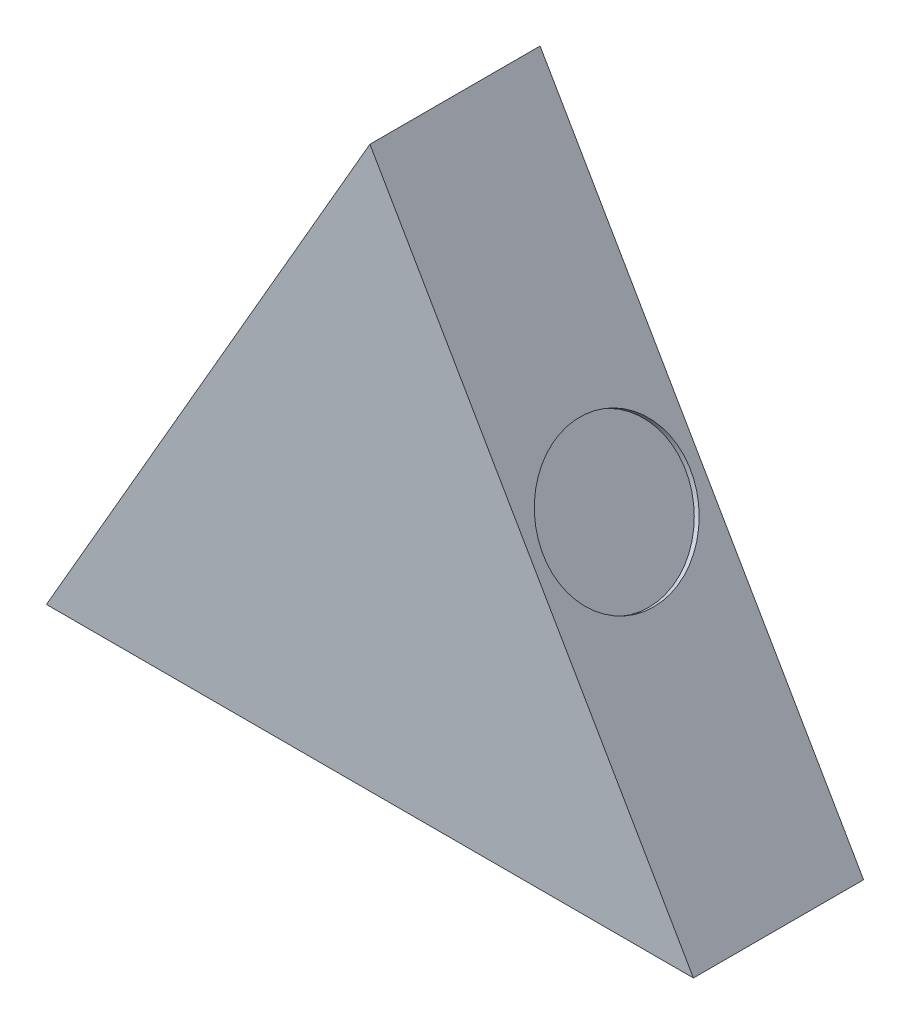
ISO-10303-21;
HEADER;
FILE_DESCRIPTION(('STEP AP214'),'2;1');
FILE_NAME('part.step','',(''),(''),'','','');
FILE_SCHEMA(('AUTOMOTIVE_DESIGN { 1 0 10303 214 1 1 1 1 }'));
ENDSEC;
DATA;
#1=APPLICATION_CONTEXT('core data for automotive mechanical design processes');
#2=APPLICATION_PROTOCOL_DEFINITION('international standard','automotive_design',2000,#1);
#3=PRODUCT_CONTEXT('',#1,'mechanical');
#4=PRODUCT('Part','Part','',(#3));
#5=PRODUCT_RELATED_PRODUCT_CATEGORY('part','',(#4));
#6=PRODUCT_DEFINITION_FORMATION('','',#4);
#7=PRODUCT_DEFINITION_CONTEXT('part definition',#1,'design');
#8=PRODUCT_DEFINITION('design','',#6,#7);
#9=PRODUCT_DEFINITION_SHAPE('','',#8);
#10=(LENGTH_UNIT() NAMED_UNIT(*) SI_UNIT(.MILLI.,.METRE.));
#11=(NAMED_UNIT(*) PLANE_ANGLE_UNIT() SI_UNIT($,.RADIAN.));
#12=(NAMED_UNIT(*) SI_UNIT($,.STERADIAN.) SOLID_ANGLE_UNIT());
#13=UNCERTAINTY_MEASURE_WITH_UNIT(LENGTH_MEASURE(1.E-05),#10,'distance_accuracy_value','');
#14=(GEOMETRIC_REPRESENTATION_CONTEXT(3) GLOBAL_UNCERTAINTY_ASSIGNED_CONTEXT((#13)) GLOBAL_UNIT_ASSIGNED_CONTEXT((#10,
#11,#12)) REPRESENTATION_CONTEXT('',''));
#15=CARTESIAN_POINT('',(0.,0.,0.));
#16=DIRECTION('',(0.,0.,1.));
#17=DIRECTION('',(1.,0.,0.));
#18=AXIS2_PLACEMENT_3D('',#15,#16,#17);
#19=CARTESIAN_POINT('',(0.,0.,0.));
#20=DIRECTION('',(0.,0.,1.));
#21=DIRECTION('',(1.,0.,0.));
#22=AXIS2_PLACEMENT_3D('',#19,#20,#21);
#23=PLANE('',#22);
#24=DIRECTION('',(-0.500000000000001,0.866025403784438,0.));
#25=VECTOR('',#24,1.);
#26=CARTESIAN_POINT('',(28.5177788775064,-24.6971209674279,0.));
#27=LINE('',#26,#25);
#28=CARTESIAN_POINT('',(28.5177788775064,-24.6971209674279,0.));
#29=VERTEX_POINT('',#28);
#30=CARTESIAN_POINT('',(-2.48065457064683E-13,24.6971209674279,0.));
#31=VERTEX_POINT('',#30);
#32=EDGE_CURVE('E163',#29,#31,#27,.T.);
#33=ORIENTED_EDGE('',*,*,#32,.F.);
#34=DIRECTION('',(1.,0.,0.));
#35=VECTOR('',#34,1.);
#36=CARTESIAN_POINT('',(-28.5177788775064,-24.6971209674279,0.));
#37=LINE('',#36,#35);
#38=CARTESIAN_POINT('',(-28.5177788775064,-24.6971209674279,0.));
#39=VERTEX_POINT('',#38);
#40=EDGE_CURVE('E79',#39,#29,#37,.T.);
#41=ORIENTED_EDGE('',*,*,#40,.F.);
#42=DIRECTION('',(-0.499999999999995,-0.866025403784442,0.));
#43=VECTOR('',#42,1.);
#44=CARTESIAN_POINT('',(-2.48065457064683E-13,24.6971209674279,0.));
#45=LINE('',#44,#43);
#46=EDGE_CURVE('E167',#31,#39,#45,.T.);
#47=ORIENTED_EDGE('',*,*,#46,.F.);
#48=EDGE_LOOP('',(#33,#41,#47));
#49=FACE_BOUND('',#48,.T.);
#50=CARTESIAN_POINT('',(0.,6.58100089794191,0.));
#51=DIRECTION('',(0.,0.,1.));
#52=DIRECTION('',(1.,0.,0.));
#53=AXIS2_PLACEMENT_3D('',#50,#51,#52);
#54=CIRCLE('',#53,3.92145220783505);
#55=CARTESIAN_POINT('',(2.37631234562467,9.70044428649156,0.));
#56=VERTEX_POINT('',#55);
#57=CARTESIAN_POINT('',(-2.37631234562468,9.70044428649156,0.));
#58=VERTEX_POINT('',#57);
#59=EDGE_CURVE('E53',#56,#58,#54,.T.);
#60=ORIENTED_EDGE('',*,*,#59,.T.);
#61=DIRECTION('',(-0.976410228367284,-0.215923750291041,0.));
#62=VECTOR('',#61,1.);
#63=CARTESIAN_POINT('',(-2.37631234562468,9.70044428649156,0.));
#64=LINE('',#63,#62);
#65=CARTESIAN_POINT('',(-3.41776144469771,9.47013781419549,0.));
#66=VERTEX_POINT('',#65);
#67=EDGE_CURVE('E162',#58,#66,#64,.T.);
#68=ORIENTED_EDGE('',*,*,#67,.T.);
#69=CARTESIAN_POINT('',(0.,-3.56299926426535,0.));
#70=DIRECTION('',(0.,0.,1.));
#71=DIRECTION('',(1.,0.,0.));
#72=AXIS2_PLACEMENT_3D('',#69,#70,#71);
#73=CIRCLE('',#72,13.4738174026077);
#74=CARTESIAN_POINT('',(-13.4738174026077,-3.56299926426536,0.));
#75=VERTEX_POINT('',#74);
#76=EDGE_CURVE('E245',#66,#75,#73,.T.);
#77=ORIENTED_EDGE('',*,*,#76,.T.);
#78=DIRECTION('',(0.,-1.,0.));
#79=VECTOR('',#78,1.);
#80=CARTESIAN_POINT('',(-13.4738174026077,-3.56299926426536,0.));
#81=LINE('',#80,#79);
#82=CARTESIAN_POINT('',(-13.4738174026077,-20.0629992642654,0.));
#83=VERTEX_POINT('',#82);
#84=EDGE_CURVE('E248',#75,#83,#81,.T.);
#85=ORIENTED_EDGE('',*,*,#84,.T.);
#86=CARTESIAN_POINT('',(-10.,-20.0629992642654,0.));
#87=DIRECTION('',(0.,0.,1.));
#88=DIRECTION('',(1.,0.,0.));
#89=AXIS2_PLACEMENT_3D('',#86,#87,#88);
#90=CIRCLE('',#89,3.47381740260768);
#91=CARTESIAN_POINT('',(-10.,-23.5368166668731,0.));
#92=VERTEX_POINT('',#91);
#93=EDGE_CURVE('E251',#83,#92,#90,.T.);
#94=ORIENTED_EDGE('',*,*,#93,.T.);
#95=DIRECTION('',(1.,0.,0.));
#96=VECTOR('',#95,1.);
#97=CARTESIAN_POINT('',(-10.,-23.5368166668731,0.));
#98=LINE('',#97,#96);
#99=CARTESIAN_POINT('',(10.,-23.536816666873,0.));
#100=VERTEX_POINT('',#99);
#101=EDGE_CURVE('E254',#92,#100,#98,.T.);
#102=ORIENTED_EDGE('',*,*,#101,.T.);
#103=CARTESIAN_POINT('',(10.,-20.0629992642654,0.));
#104=DIRECTION('',(0.,0.,1.));
#105=DIRECTION('',(1.,0.,0.));
#106=AXIS2_PLACEMENT_3D('',#103,#104,#105);
#107=CIRCLE('',#106,3.47381740260768);
#108=CARTESIAN_POINT('',(13.4738174026077,-20.0629992642654,0.));
#109=VERTEX_POINT('',#108);
#110=EDGE_CURVE('E257',#100,#109,#107,.T.);
#111=ORIENTED_EDGE('',*,*,#110,.T.);
#112=DIRECTION('',(0.,1.,0.));
#113=VECTOR('',#112,1.);
#114=CARTESIAN_POINT('',(13.4738174026077,-3.56299926426536,0.));
#115=LINE('',#114,#113);
#116=CARTESIAN_POINT('',(13.4738174026077,-3.56299926426535,0.));
#117=VERTEX_POINT('',#116);
#118=EDGE_CURVE('E260',#109,#117,#115,.T.);
#119=ORIENTED_EDGE('',*,*,#118,.T.);
#120=CARTESIAN_POINT('',(0.,-3.56299926426535,0.));
#121=DIRECTION('',(0.,0.,1.));
#122=DIRECTION('',(1.,0.,0.));
#123=AXIS2_PLACEMENT_3D('',#120,#121,#122);
#124=CIRCLE('',#123,13.4738174026077);
#125=CARTESIAN_POINT('',(3.41776144469768,9.4701378141955,0.));
#126=VERTEX_POINT('',#125);
#127=EDGE_CURVE('E263',#117,#126,#124,.T.);
#128=ORIENTED_EDGE('',*,*,#127,.T.);
#129=DIRECTION('',(-0.976410228367284,0.215923750291041,0.));
#130=VECTOR('',#129,1.);
#131=CARTESIAN_POINT('',(2.37631234562467,9.70044428649157,0.));
#132=LINE('',#131,#130);
#133=EDGE_CURVE('E158',#126,#56,#132,.T.);
#134=ORIENTED_EDGE('',*,*,#133,.T.);
#135=EDGE_LOOP('',(#60,#68,#77,#85,#94,#102,#111,#119,#128,#134));
#136=FACE_BOUND('',#135,.T.);
#137=ADVANCED_FACE('F38',(#49,#136),#23,.F.);
#138=CARTESIAN_POINT('',(28.5177788775064,-24.6971209674279,15.));
#139=DIRECTION('',(-0.866025403784438,-0.500000000000001,0.));
#140=DIRECTION('',(0.500000000000001,-0.866025403784438,0.));
#141=AXIS2_PLACEMENT_3D('',#138,#139,#140);
#142=PLANE('',#141);
#143=CARTESIAN_POINT('',(14.2588894387531,-1.5292080969564E-13,7.5));
#144=DIRECTION('',(-0.866025403784438,-0.500000000000001,0.));
#145=DIRECTION('',(0.500000000000001,-0.866025403784438,0.));
#146=AXIS2_PLACEMENT_3D('',#143,#144,#145);
#147=CIRCLE('',#146,6.5);
#148=CARTESIAN_POINT('',(17.5088894387532,-5.629165124599,7.5));
#149=VERTEX_POINT('',#148);
#150=EDGE_CURVE('E219',#149,#149,#147,.T.);
#151=ORIENTED_EDGE('',*,*,#150,.T.);
#152=EDGE_LOOP('',(#151));
#153=FACE_BOUND('',#152,.T.);
#154=ORIENTED_EDGE('',*,*,#32,.T.);
#155=DIRECTION('',(0.,0.,-1.));
#156=VECTOR('',#155,1.);
#157=CARTESIAN_POINT('',(-2.48065457064683E-13,24.6971209674279,15.));
#158=LINE('',#157,#156);
#159=CARTESIAN_POINT('',(-2.48065457064683E-13,24.6971209674279,15.));
#160=VERTEX_POINT('',#159);
#161=EDGE_CURVE('E11',#160,#31,#158,.T.);
#162=ORIENTED_EDGE('',*,*,#161,.F.);
#163=DIRECTION('',(-0.500000000000001,0.866025403784438,0.));
#164=VECTOR('',#163,1.);
#165=CARTESIAN_POINT('',(28.5177788775064,-24.6971209674279,15.));
#166=LINE('',#165,#164);
#167=CARTESIAN_POINT('',(28.5177788775064,-24.6971209674279,15.));
#168=VERTEX_POINT('',#167);
#169=EDGE_CURVE('E173',#168,#160,#166,.T.);
#170=ORIENTED_EDGE('',*,*,#169,.F.);
#171=DIRECTION('',(0.,0.,-1.));
#172=VECTOR('',#171,1.);
#173=CARTESIAN_POINT('',(28.5177788775064,-24.6971209674279,15.));
#174=LINE('',#173,#172);
#175=EDGE_CURVE('E176',#168,#29,#174,.T.);
#176=ORIENTED_EDGE('',*,*,#175,.T.);
#177=EDGE_LOOP('',(#154,#162,#170,#176));
#178=FACE_BOUND('',#177,.T.);
#179=ADVANCED_FACE('F40',(#153,#178),#142,.F.);
#180=CARTESIAN_POINT('',(-2.48065457064683E-13,24.6971209674279,15.));
#181=DIRECTION('',(0.866025403784442,-0.499999999999995,0.));
#182=DIRECTION('',(0.499999999999995,0.866025403784442,0.));
#183=AXIS2_PLACEMENT_3D('',#180,#181,#182);
#184=PLANE('',#183);
#185=CARTESIAN_POINT('',(-14.2588894387533,0.,7.5));
#186=DIRECTION('',(0.866025403784442,-0.499999999999995,0.));
#187=DIRECTION('',(0.499999999999995,0.866025403784442,0.));
#188=AXIS2_PLACEMENT_3D('',#185,#186,#187);
#189=CIRCLE('',#188,6.5);
#190=CARTESIAN_POINT('',(-11.0088894387534,5.62916512459883,7.5));
#191=VERTEX_POINT('',#190);
#192=EDGE_CURVE('E210',#191,#191,#189,.T.);
#193=ORIENTED_EDGE('',*,*,#192,.T.);
#194=EDGE_LOOP('',(#193));
#195=FACE_BOUND('',#194,.T.);
#196=ORIENTED_EDGE('',*,*,#46,.T.);
#197=DIRECTION('',(0.,0.,-1.));
#198=VECTOR('',#197,1.);
#199=CARTESIAN_POINT('',(-28.5177788775064,-24.6971209674279,15.));
#200=LINE('',#199,#198);
#201=CARTESIAN_POINT('',(-28.5177788775064,-24.6971209674279,15.));
#202=VERTEX_POINT('',#201);
#203=EDGE_CURVE('E46',#202,#39,#200,.T.);
#204=ORIENTED_EDGE('',*,*,#203,.F.);
#205=DIRECTION('',(-0.499999999999995,-0.866025403784442,0.));
#206=VECTOR('',#205,1.);
#207=CARTESIAN_POINT('',(-2.48065457064683E-13,24.6971209674279,15.));
#208=LINE('',#207,#206);
#209=EDGE_CURVE('E84',#160,#202,#208,.T.);
#210=ORIENTED_EDGE('',*,*,#209,.F.);
#211=ORIENTED_EDGE('',*,*,#161,.T.);
#212=EDGE_LOOP('',(#196,#204,#210,#211));
#213=FACE_BOUND('',#212,.T.);
#214=ADVANCED_FACE('F195',(#195,#213),#184,.F.);
#215=CARTESIAN_POINT('',(-28.5177788775064,-24.6971209674279,15.));
#216=DIRECTION('',(0.,1.,0.));
#217=DIRECTION('',(0.,0.,1.));
#218=AXIS2_PLACEMENT_3D('',#215,#216,#217);
#219=PLANE('',#218);
#220=CARTESIAN_POINT('',(0.,-24.6971209674279,7.5));
#221=DIRECTION('',(0.,-1.,0.));
#222=DIRECTION('',(0.,0.,-1.));
#223=AXIS2_PLACEMENT_3D('',#220,#221,#222);
#224=CIRCLE('',#223,6.5);
#225=CARTESIAN_POINT('',(0.,-24.6971209674279,0.999999999999999));
#226=VERTEX_POINT('',#225);
#227=EDGE_CURVE('E216',#226,#226,#224,.T.);
#228=ORIENTED_EDGE('',*,*,#227,.F.);
#229=EDGE_LOOP('',(#228));
#230=FACE_BOUND('',#229,.T.);
#231=ORIENTED_EDGE('',*,*,#40,.T.);
#232=ORIENTED_EDGE('',*,*,#175,.F.);
#233=DIRECTION('',(1.,0.,0.));
#234=VECTOR('',#233,1.);
#235=CARTESIAN_POINT('',(-28.5177788775064,-24.6971209674279,15.));
#236=LINE('',#235,#234);
#237=EDGE_CURVE('E62',#202,#168,#236,.T.);
#238=ORIENTED_EDGE('',*,*,#237,.F.);
#239=ORIENTED_EDGE('',*,*,#203,.T.);
#240=EDGE_LOOP('',(#231,#232,#238,#239));
#241=FACE_BOUND('',#240,.T.);
#242=ADVANCED_FACE('F180',(#230,#241),#219,.F.);
#243=CARTESIAN_POINT('',(0.,0.,15.));
#244=DIRECTION('',(0.,0.,1.));
#245=DIRECTION('',(1.,0.,0.));
#246=AXIS2_PLACEMENT_3D('',#243,#244,#245);
#247=PLANE('',#246);
#248=ORIENTED_EDGE('',*,*,#169,.T.);
#249=ORIENTED_EDGE('',*,*,#209,.T.);
#250=ORIENTED_EDGE('',*,*,#237,.T.);
#251=EDGE_LOOP('',(#248,#249,#250));
#252=FACE_BOUND('',#251,.T.);
#253=ADVANCED_FACE('F187',(#252),#247,.T.);
#254=CARTESIAN_POINT('',(0.,6.58100089794191,13.));
#255=DIRECTION('',(0.,0.,-1.));
#256=DIRECTION('',(-1.,0.,0.));
#257=AXIS2_PLACEMENT_3D('',#254,#255,#256);
#258=CYLINDRICAL_SURFACE('',#257,3.92145220783505);
#259=ORIENTED_EDGE('',*,*,#59,.F.);
#260=DIRECTION('',(0.,0.,-1.));
#261=VECTOR('',#260,1.);
#262=CARTESIAN_POINT('',(2.37631234562467,9.70044428649157,13.));
#263=LINE('',#262,#261);
#264=CARTESIAN_POINT('',(2.37631234562467,9.70044428649157,13.));
#265=VERTEX_POINT('',#264);
#266=EDGE_CURVE('E157',#265,#56,#263,.T.);
#267=ORIENTED_EDGE('',*,*,#266,.F.);
#268=CARTESIAN_POINT('',(0.,6.58100089794191,13.));
#269=DIRECTION('',(0.,0.,1.));
#270=DIRECTION('',(1.,0.,0.));
#271=AXIS2_PLACEMENT_3D('',#268,#269,#270);
#272=CIRCLE('',#271,3.92145220783505);
#273=CARTESIAN_POINT('',(-2.37631234562468,9.70044428649156,13.));
#274=VERTEX_POINT('',#273);
#275=EDGE_CURVE('E148',#265,#274,#272,.T.);
#276=ORIENTED_EDGE('',*,*,#275,.T.);
#277=DIRECTION('',(0.,0.,-1.));
#278=VECTOR('',#277,1.);
#279=CARTESIAN_POINT('',(-2.37631234562468,9.70044428649156,13.));
#280=LINE('',#279,#278);
#281=EDGE_CURVE('E156',#274,#58,#280,.T.);
#282=ORIENTED_EDGE('',*,*,#281,.T.);
#283=EDGE_LOOP('',(#259,#267,#276,#282));
#284=FACE_BOUND('',#283,.T.);
#285=ADVANCED_FACE('F155',(#284),#258,.F.);
#286=CARTESIAN_POINT('',(-2.37631234562468,9.70044428649156,13.));
#287=DIRECTION('',(0.215923750291041,-0.976410228367284,0.));
#288=DIRECTION('',(0.976410228367284,0.215923750291041,0.));
#289=AXIS2_PLACEMENT_3D('',#286,#287,#288);
#290=PLANE('',#289);
#291=ORIENTED_EDGE('',*,*,#67,.F.);
#292=ORIENTED_EDGE('',*,*,#281,.F.);
#293=DIRECTION('',(-0.976410228367284,-0.215923750291041,0.));
#294=VECTOR('',#293,1.);
#295=CARTESIAN_POINT('',(-2.37631234562468,9.70044428649156,13.));
#296=LINE('',#295,#294);
#297=CARTESIAN_POINT('',(-3.41776144469771,9.47013781419549,13.));
#298=VERTEX_POINT('',#297);
#299=EDGE_CURVE('E144',#274,#298,#296,.T.);
#300=ORIENTED_EDGE('',*,*,#299,.T.);
#301=DIRECTION('',(0.,0.,-1.));
#302=VECTOR('',#301,1.);
#303=CARTESIAN_POINT('',(-3.41776144469771,9.47013781419549,13.));
#304=LINE('',#303,#302);
#305=EDGE_CURVE('E164',#298,#66,#304,.T.);
#306=ORIENTED_EDGE('',*,*,#305,.T.);
#307=EDGE_LOOP('',(#291,#292,#300,#306));
#308=FACE_BOUND('',#307,.T.);
#309=ADVANCED_FACE('F160',(#308),#290,.T.);
#310=CARTESIAN_POINT('',(0.,-3.56299926426535,13.));
#311=DIRECTION('',(0.,0.,-1.));
#312=DIRECTION('',(-1.,0.,0.));
#313=AXIS2_PLACEMENT_3D('',#310,#311,#312);
#314=CYLINDRICAL_SURFACE('',#313,13.4738174026077);
#315=ORIENTED_EDGE('',*,*,#76,.F.);
#316=ORIENTED_EDGE('',*,*,#305,.F.);
#317=CARTESIAN_POINT('',(0.,-3.56299926426535,13.));
#318=DIRECTION('',(0.,0.,1.));
#319=DIRECTION('',(1.,0.,0.));
#320=AXIS2_PLACEMENT_3D('',#317,#318,#319);
#321=CIRCLE('',#320,13.4738174026077);
#322=CARTESIAN_POINT('',(-13.4738174026077,-3.56299926426536,13.));
#323=VERTEX_POINT('',#322);
#324=EDGE_CURVE('E150',#298,#323,#321,.T.);
#325=ORIENTED_EDGE('',*,*,#324,.T.);
#326=DIRECTION('',(0.,0.,-1.));
#327=VECTOR('',#326,1.);
#328=CARTESIAN_POINT('',(-13.4738174026077,-3.56299926426536,13.));
#329=LINE('',#328,#327);
#330=EDGE_CURVE('E169',#323,#75,#329,.T.);
#331=ORIENTED_EDGE('',*,*,#330,.T.);
#332=EDGE_LOOP('',(#315,#316,#325,#331));
#333=FACE_BOUND('',#332,.T.);
#334=ADVANCED_FACE('F284',(#333),#314,.F.);
#335=CARTESIAN_POINT('',(-13.4738174026077,-3.56299926426536,13.));
#336=DIRECTION('',(1.,0.,0.));
#337=DIRECTION('',(0.,0.,-1.));
#338=AXIS2_PLACEMENT_3D('',#335,#336,#337);
#339=PLANE('',#338);
#340=ORIENTED_EDGE('',*,*,#84,.F.);
#341=ORIENTED_EDGE('',*,*,#330,.F.);
#342=DIRECTION('',(0.,-1.,0.));
#343=VECTOR('',#342,1.);
#344=CARTESIAN_POINT('',(-13.4738174026077,-3.56299926426536,13.));
#345=LINE('',#344,#343);
#346=CARTESIAN_POINT('',(-13.4738174026077,-20.0629992642654,13.));
#347=VERTEX_POINT('',#346);
#348=EDGE_CURVE('E229',#323,#347,#345,.T.);
#349=ORIENTED_EDGE('',*,*,#348,.T.);
#350=DIRECTION('',(0.,0.,-1.));
#351=VECTOR('',#350,1.);
#352=CARTESIAN_POINT('',(-13.4738174026077,-20.0629992642654,13.));
#353=LINE('',#352,#351);
#354=EDGE_CURVE('E279',#347,#83,#353,.T.);
#355=ORIENTED_EDGE('',*,*,#354,.T.);
#356=EDGE_LOOP('',(#340,#341,#349,#355));
#357=FACE_BOUND('',#356,.T.);
#358=ADVANCED_FACE('F286',(#357),#339,.T.);
#359=CARTESIAN_POINT('',(-10.,-20.0629992642654,13.));
#360=DIRECTION('',(0.,0.,-1.));
#361=DIRECTION('',(-1.,0.,0.));
#362=AXIS2_PLACEMENT_3D('',#359,#360,#361);
#363=CYLINDRICAL_SURFACE('',#362,3.47381740260768);
#364=ORIENTED_EDGE('',*,*,#93,.F.);
#365=ORIENTED_EDGE('',*,*,#354,.F.);
#366=CARTESIAN_POINT('',(-10.,-20.0629992642654,13.));
#367=DIRECTION('',(0.,0.,1.));
#368=DIRECTION('',(1.,0.,0.));
#369=AXIS2_PLACEMENT_3D('',#366,#367,#368);
#370=CIRCLE('',#369,3.47381740260768);
#371=CARTESIAN_POINT('',(-10.,-23.5368166668731,13.));
#372=VERTEX_POINT('',#371);
#373=EDGE_CURVE('E231',#347,#372,#370,.T.);
#374=ORIENTED_EDGE('',*,*,#373,.T.);
#375=DIRECTION('',(0.,0.,-1.));
#376=VECTOR('',#375,1.);
#377=CARTESIAN_POINT('',(-10.,-23.5368166668731,13.));
#378=LINE('',#377,#376);
#379=EDGE_CURVE('E277',#372,#92,#378,.T.);
#380=ORIENTED_EDGE('',*,*,#379,.T.);
#381=EDGE_LOOP('',(#364,#365,#374,#380));
#382=FACE_BOUND('',#381,.T.);
#383=ADVANCED_FACE('F315',(#382),#363,.F.);
#384=CARTESIAN_POINT('',(-10.,-23.5368166668731,13.));
#385=DIRECTION('',(0.,1.,0.));
#386=DIRECTION('',(0.,0.,1.));
#387=AXIS2_PLACEMENT_3D('',#384,#385,#386);
#388=PLANE('',#387);
#389=ORIENTED_EDGE('',*,*,#101,.F.);
#390=ORIENTED_EDGE('',*,*,#379,.F.);
#391=DIRECTION('',(1.,0.,0.));
#392=VECTOR('',#391,1.);
#393=CARTESIAN_POINT('',(-10.,-23.5368166668731,13.));
#394=LINE('',#393,#392);
#395=CARTESIAN_POINT('',(10.,-23.536816666873,13.));
#396=VERTEX_POINT('',#395);
#397=EDGE_CURVE('E233',#372,#396,#394,.T.);
#398=ORIENTED_EDGE('',*,*,#397,.T.);
#399=DIRECTION('',(0.,0.,-1.));
#400=VECTOR('',#399,1.);
#401=CARTESIAN_POINT('',(10.,-23.536816666873,13.));
#402=LINE('',#401,#400);
#403=EDGE_CURVE('E275',#396,#100,#402,.T.);
#404=ORIENTED_EDGE('',*,*,#403,.T.);
#405=EDGE_LOOP('',(#389,#390,#398,#404));
#406=FACE_BOUND('',#405,.T.);
#407=ADVANCED_FACE('F313',(#406),#388,.T.);
#408=CARTESIAN_POINT('',(10.,-20.0629992642654,13.));
#409=DIRECTION('',(0.,0.,-1.));
#410=DIRECTION('',(-1.,0.,0.));
#411=AXIS2_PLACEMENT_3D('',#408,#409,#410);
#412=CYLINDRICAL_SURFACE('',#411,3.47381740260768);
#413=ORIENTED_EDGE('',*,*,#110,.F.);
#414=ORIENTED_EDGE('',*,*,#403,.F.);
#415=CARTESIAN_POINT('',(10.,-20.0629992642654,13.));
#416=DIRECTION('',(0.,0.,1.));
#417=DIRECTION('',(1.,0.,0.));
#418=AXIS2_PLACEMENT_3D('',#415,#416,#417);
#419=CIRCLE('',#418,3.47381740260768);
#420=CARTESIAN_POINT('',(13.4738174026077,-20.0629992642654,13.));
#421=VERTEX_POINT('',#420);
#422=EDGE_CURVE('E235',#396,#421,#419,.T.);
#423=ORIENTED_EDGE('',*,*,#422,.T.);
#424=DIRECTION('',(0.,0.,-1.));
#425=VECTOR('',#424,1.);
#426=CARTESIAN_POINT('',(13.4738174026077,-20.0629992642654,13.));
#427=LINE('',#426,#425);
#428=EDGE_CURVE('E273',#421,#109,#427,.T.);
#429=ORIENTED_EDGE('',*,*,#428,.T.);
#430=EDGE_LOOP('',(#413,#414,#423,#429));
#431=FACE_BOUND('',#430,.T.);
#432=ADVANCED_FACE('F306',(#431),#412,.F.);
#433=CARTESIAN_POINT('',(13.4738174026077,-3.56299926426536,13.));
#434=DIRECTION('',(-1.,0.,0.));
#435=DIRECTION('',(0.,0.,1.));
#436=AXIS2_PLACEMENT_3D('',#433,#434,#435);
#437=PLANE('',#436);
#438=ORIENTED_EDGE('',*,*,#118,.F.);
#439=ORIENTED_EDGE('',*,*,#428,.F.);
#440=DIRECTION('',(0.,1.,0.));
#441=VECTOR('',#440,1.);
#442=CARTESIAN_POINT('',(13.4738174026077,-3.56299926426536,13.));
#443=LINE('',#442,#441);
#444=CARTESIAN_POINT('',(13.4738174026077,-3.56299926426535,13.));
#445=VERTEX_POINT('',#444);
#446=EDGE_CURVE('E237',#421,#445,#443,.T.);
#447=ORIENTED_EDGE('',*,*,#446,.T.);
#448=DIRECTION('',(0.,0.,-1.));
#449=VECTOR('',#448,1.);
#450=CARTESIAN_POINT('',(13.4738174026077,-3.56299926426535,13.));
#451=LINE('',#450,#449);
#452=EDGE_CURVE('E271',#445,#117,#451,.T.);
#453=ORIENTED_EDGE('',*,*,#452,.T.);
#454=EDGE_LOOP('',(#438,#439,#447,#453));
#455=FACE_BOUND('',#454,.T.);
#456=ADVANCED_FACE('F302',(#455),#437,.T.);
#457=CARTESIAN_POINT('',(0.,-3.56299926426535,13.));
#458=DIRECTION('',(0.,0.,-1.));
#459=DIRECTION('',(-1.,0.,0.));
#460=AXIS2_PLACEMENT_3D('',#457,#458,#459);
#461=CYLINDRICAL_SURFACE('',#460,13.4738174026077);
#462=ORIENTED_EDGE('',*,*,#127,.F.);
#463=ORIENTED_EDGE('',*,*,#452,.F.);
#464=CARTESIAN_POINT('',(0.,-3.56299926426535,13.));
#465=DIRECTION('',(0.,0.,1.));
#466=DIRECTION('',(1.,0.,0.));
#467=AXIS2_PLACEMENT_3D('',#464,#465,#466);
#468=CIRCLE('',#467,13.4738174026077);
#469=CARTESIAN_POINT('',(3.41776144469768,9.4701378141955,13.));
#470=VERTEX_POINT('',#469);
#471=EDGE_CURVE('E239',#445,#470,#468,.T.);
#472=ORIENTED_EDGE('',*,*,#471,.T.);
#473=DIRECTION('',(0.,0.,-1.));
#474=VECTOR('',#473,1.);
#475=CARTESIAN_POINT('',(3.41776144469768,9.4701378141955,13.));
#476=LINE('',#475,#474);
#477=EDGE_CURVE('E269',#470,#126,#476,.T.);
#478=ORIENTED_EDGE('',*,*,#477,.T.);
#479=EDGE_LOOP('',(#462,#463,#472,#478));
#480=FACE_BOUND('',#479,.T.);
#481=ADVANCED_FACE('F299',(#480),#461,.F.);
#482=CARTESIAN_POINT('',(2.37631234562467,9.70044428649157,13.));
#483=DIRECTION('',(-0.215923750291041,-0.976410228367284,0.));
#484=DIRECTION('',(0.976410228367285,-0.215923750291041,0.));
#485=AXIS2_PLACEMENT_3D('',#482,#483,#484);
#486=PLANE('',#485);
#487=ORIENTED_EDGE('',*,*,#133,.F.);
#488=ORIENTED_EDGE('',*,*,#477,.F.);
#489=DIRECTION('',(-0.976410228367284,0.215923750291041,0.));
#490=VECTOR('',#489,1.);
#491=CARTESIAN_POINT('',(2.37631234562467,9.70044428649157,13.));
#492=LINE('',#491,#490);
#493=EDGE_CURVE('E241',#470,#265,#492,.T.);
#494=ORIENTED_EDGE('',*,*,#493,.T.);
#495=ORIENTED_EDGE('',*,*,#266,.T.);
#496=EDGE_LOOP('',(#487,#488,#494,#495));
#497=FACE_BOUND('',#496,.T.);
#498=ADVANCED_FACE('F293',(#497),#486,.T.);
#499=CARTESIAN_POINT('',(0.,6.58100089794191,13.));
#500=DIRECTION('',(0.,0.,1.));
#501=DIRECTION('',(1.,0.,0.));
#502=AXIS2_PLACEMENT_3D('',#499,#500,#501);
#503=PLANE('',#502);
#504=ORIENTED_EDGE('',*,*,#275,.F.);
#505=ORIENTED_EDGE('',*,*,#493,.F.);
#506=ORIENTED_EDGE('',*,*,#471,.F.);
#507=ORIENTED_EDGE('',*,*,#446,.F.);
#508=ORIENTED_EDGE('',*,*,#422,.F.);
#509=ORIENTED_EDGE('',*,*,#397,.F.);
#510=ORIENTED_EDGE('',*,*,#373,.F.);
#511=ORIENTED_EDGE('',*,*,#348,.F.);
#512=ORIENTED_EDGE('',*,*,#324,.F.);
#513=ORIENTED_EDGE('',*,*,#299,.F.);
#514=EDGE_LOOP('',(#504,#505,#506,#507,#508,#509,#510,#511,#512,#513));
#515=FACE_BOUND('',#514,.T.);
#516=ADVANCED_FACE('F146',(#515),#503,.F.);
#517=CARTESIAN_POINT('',(0.,-24.1971209674279,7.5));
#518=DIRECTION('',(0.,-1.,0.));
#519=DIRECTION('',(0.,0.,-1.));
#520=AXIS2_PLACEMENT_3D('',#517,#518,#519);
#521=CYLINDRICAL_SURFACE('',#520,6.5);
#522=CARTESIAN_POINT('',(0.,-24.1971209674279,7.5));
#523=DIRECTION('',(0.,-1.,0.));
#524=DIRECTION('',(0.,0.,-1.));
#525=AXIS2_PLACEMENT_3D('',#522,#523,#524);
#526=CIRCLE('',#525,6.5);
#527=CARTESIAN_POINT('',(0.,-24.1971209674279,0.999999999999999));
#528=VERTEX_POINT('',#527);
#529=EDGE_CURVE('E223',#528,#528,#526,.T.);
#530=ORIENTED_EDGE('',*,*,#529,.F.);
#531=EDGE_LOOP('',(#530));
#532=FACE_BOUND('',#531,.T.);
#533=ORIENTED_EDGE('',*,*,#227,.T.);
#534=EDGE_LOOP('',(#533));
#535=FACE_BOUND('',#534,.T.);
#536=ADVANCED_FACE('F398',(#532,#535),#521,.F.);
#537=CARTESIAN_POINT('',(0.,-24.1971209674279,7.5));
#538=DIRECTION('',(0.,-1.,0.));
#539=DIRECTION('',(0.,0.,-1.));
#540=AXIS2_PLACEMENT_3D('',#537,#538,#539);
#541=PLANE('',#540);
#542=ORIENTED_EDGE('',*,*,#529,.T.);
#543=EDGE_LOOP('',(#542));
#544=FACE_BOUND('',#543,.T.);
#545=ADVANCED_FACE('F417',(#544),#541,.T.);
#546=CARTESIAN_POINT('',(-13.8258767368611,-0.250000000000035,7.5));
#547=DIRECTION('',(-0.866025403784442,0.499999999999995,0.));
#548=DIRECTION('',(-0.499999999999995,-0.866025403784442,0.));
#549=AXIS2_PLACEMENT_3D('',#546,#547,#548);
#550=CYLINDRICAL_SURFACE('',#549,6.5);
#551=CARTESIAN_POINT('',(-13.8258767368611,-0.250000000000035,7.5));
#552=DIRECTION('',(0.866025403784442,-0.499999999999995,0.));
#553=DIRECTION('',(0.499999999999995,0.866025403784442,0.));
#554=AXIS2_PLACEMENT_3D('',#551,#552,#553);
#555=CIRCLE('',#554,6.5);
#556=CARTESIAN_POINT('',(-10.5758767368611,5.37916512459884,7.5));
#557=VERTEX_POINT('',#556);
#558=EDGE_CURVE('E212',#557,#557,#555,.T.);
#559=ORIENTED_EDGE('',*,*,#558,.T.);
#560=EDGE_LOOP('',(#559));
#561=FACE_BOUND('',#560,.T.);
#562=ORIENTED_EDGE('',*,*,#192,.F.);
#563=EDGE_LOOP('',(#562));
#564=FACE_BOUND('',#563,.T.);
#565=ADVANCED_FACE('F427',(#561,#564),#550,.F.);
#566=CARTESIAN_POINT('',(-13.8258767368611,-0.250000000000035,7.5));
#567=DIRECTION('',(0.866025403784442,-0.499999999999995,0.));
#568=DIRECTION('',(0.499999999999995,0.866025403784442,0.));
#569=AXIS2_PLACEMENT_3D('',#566,#567,#568);
#570=PLANE('',#569);
#571=ORIENTED_EDGE('',*,*,#558,.F.);
#572=EDGE_LOOP('',(#571));
#573=FACE_BOUND('',#572,.T.);
#574=ADVANCED_FACE('F444',(#573),#570,.F.);
#575=CARTESIAN_POINT('',(13.8258767368609,-0.250000000000154,7.5));
#576=DIRECTION('',(0.866025403784438,0.500000000000001,0.));
#577=DIRECTION('',(-0.500000000000001,0.866025403784438,0.));
#578=AXIS2_PLACEMENT_3D('',#575,#576,#577);
#579=CYLINDRICAL_SURFACE('',#578,6.5);
#580=CARTESIAN_POINT('',(13.8258767368609,-0.250000000000154,7.5));
#581=DIRECTION('',(-0.866025403784438,-0.500000000000001,0.));
#582=DIRECTION('',(0.500000000000001,-0.866025403784438,0.));
#583=AXIS2_PLACEMENT_3D('',#580,#581,#582);
#584=CIRCLE('',#583,6.5);
#585=CARTESIAN_POINT('',(17.0758767368609,-5.879165124599,7.5));
#586=VERTEX_POINT('',#585);
#587=EDGE_CURVE('E213',#586,#586,#584,.T.);
#588=ORIENTED_EDGE('',*,*,#587,.T.);
#589=EDGE_LOOP('',(#588));
#590=FACE_BOUND('',#589,.T.);
#591=ORIENTED_EDGE('',*,*,#150,.F.);
#592=EDGE_LOOP('',(#591));
#593=FACE_BOUND('',#592,.T.);
#594=ADVANCED_FACE('F455',(#590,#593),#579,.F.);
#595=CARTESIAN_POINT('',(13.8258767368609,-0.250000000000154,7.5));
#596=DIRECTION('',(-0.866025403784438,-0.500000000000001,0.));
#597=DIRECTION('',(0.500000000000001,-0.866025403784438,0.));
#598=AXIS2_PLACEMENT_3D('',#595,#596,#597);
#599=PLANE('',#598);
#600=ORIENTED_EDGE('',*,*,#587,.F.);
#601=EDGE_LOOP('',(#600));
#602=FACE_BOUND('',#601,.T.);
#603=ADVANCED_FACE('F472',(#602),#599,.F.);
#604=CLOSED_SHELL('',(#137,#179,#214,#242,#253,#285,#309,#334,#358,#383,#407,#432,#456,#481,
#498,#516,#536,#545,#565,#574,#594,#603));
#605=MANIFOLD_SOLID_BREP('B2',#604);
#606=ADVANCED_BREP_SHAPE_REPRESENTATION('',(#18,#605),#14);
#607=SHAPE_DEFINITION_REPRESENTATION(#9,#606);
ENDSEC;
END-ISO-10303-21;
